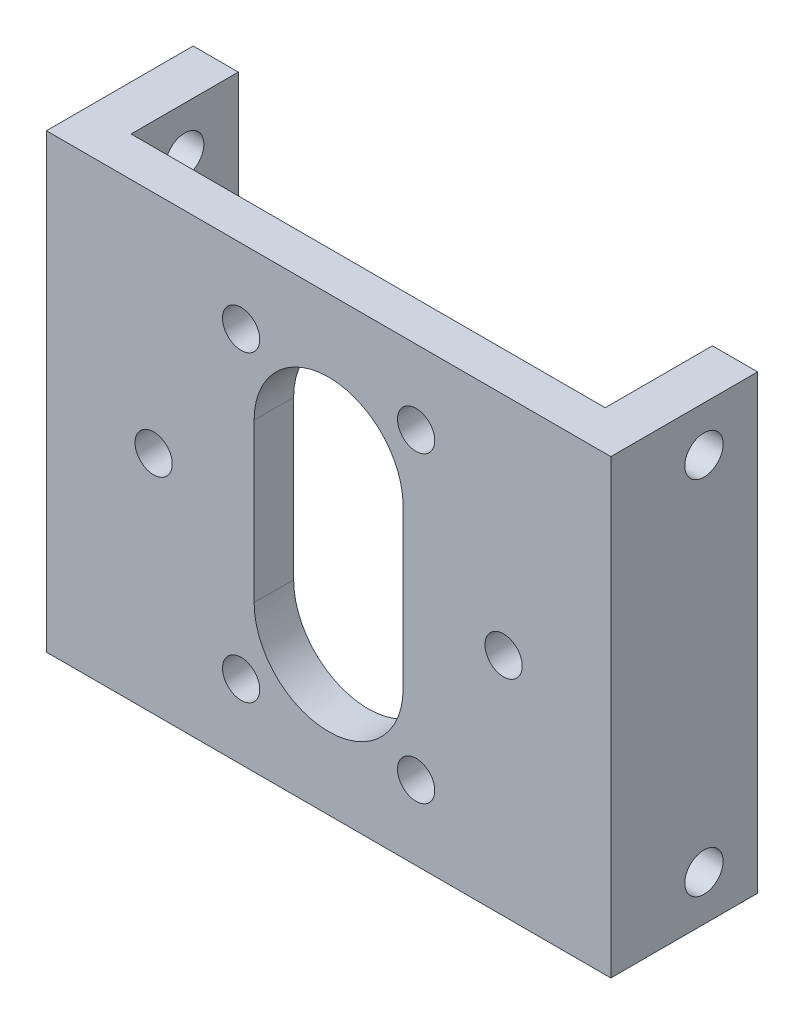
ISO-10303-21;
HEADER;
FILE_DESCRIPTION(('STEP AP214'),'2;1');
FILE_NAME('part.step','',(''),(''),'','','');
FILE_SCHEMA(('AUTOMOTIVE_DESIGN { 1 0 10303 214 1 1 1 1 }'));
ENDSEC;
DATA;
#1=APPLICATION_CONTEXT('core data for automotive mechanical design processes');
#2=APPLICATION_PROTOCOL_DEFINITION('international standard','automotive_design',2000,#1);
#3=PRODUCT_CONTEXT('',#1,'mechanical');
#4=PRODUCT('Part','Part','',(#3));
#5=PRODUCT_RELATED_PRODUCT_CATEGORY('part','',(#4));
#6=PRODUCT_DEFINITION_FORMATION('','',#4);
#7=PRODUCT_DEFINITION_CONTEXT('part definition',#1,'design');
#8=PRODUCT_DEFINITION('design','',#6,#7);
#9=PRODUCT_DEFINITION_SHAPE('','',#8);
#10=(LENGTH_UNIT() NAMED_UNIT(*) SI_UNIT(.MILLI.,.METRE.));
#11=(NAMED_UNIT(*) PLANE_ANGLE_UNIT() SI_UNIT($,.RADIAN.));
#12=(NAMED_UNIT(*) SI_UNIT($,.STERADIAN.) SOLID_ANGLE_UNIT());
#13=UNCERTAINTY_MEASURE_WITH_UNIT(LENGTH_MEASURE(1.E-05),#10,'distance_accuracy_value','');
#14=(GEOMETRIC_REPRESENTATION_CONTEXT(3) GLOBAL_UNCERTAINTY_ASSIGNED_CONTEXT((#13)) GLOBAL_UNIT_ASSIGNED_CONTEXT((#10,
#11,#12)) REPRESENTATION_CONTEXT('',''));
#15=CARTESIAN_POINT('',(0.,0.,0.));
#16=DIRECTION('',(0.,0.,1.));
#17=DIRECTION('',(1.,0.,0.));
#18=AXIS2_PLACEMENT_3D('',#15,#16,#17);
#19=CARTESIAN_POINT('',(-25.,20.,5.));
#20=DIRECTION('',(0.,-1.,0.));
#21=DIRECTION('',(1.,0.,0.));
#22=AXIS2_PLACEMENT_3D('',#19,#20,#21);
#23=PLANE('',#22);
#24=DIRECTION('',(1.,0.,0.));
#25=VECTOR('',#24,1.);
#26=CARTESIAN_POINT('',(19.,20.,1.5));
#27=LINE('',#26,#25);
#28=CARTESIAN_POINT('',(-21.,20.,1.5));
#29=VERTEX_POINT('',#28);
#30=CARTESIAN_POINT('',(21.,20.,1.5));
#31=VERTEX_POINT('',#30);
#32=EDGE_CURVE('E128',#29,#31,#27,.T.);
#33=ORIENTED_EDGE('',*,*,#32,.F.);
#34=DIRECTION('',(0.,0.,-1.));
#35=VECTOR('',#34,1.);
#36=CARTESIAN_POINT('',(-21.,20.,1.5));
#37=LINE('',#36,#35);
#38=CARTESIAN_POINT('',(-21.,20.,-8.));
#39=VERTEX_POINT('',#38);
#40=EDGE_CURVE('E149',#29,#39,#37,.T.);
#41=ORIENTED_EDGE('',*,*,#40,.T.);
#42=DIRECTION('',(1.,0.,0.));
#43=VECTOR('',#42,1.);
#44=CARTESIAN_POINT('',(-19.,20.,-8.));
#45=LINE('',#44,#43);
#46=CARTESIAN_POINT('',(-25.,20.,-8.));
#47=VERTEX_POINT('',#46);
#48=EDGE_CURVE('E251',#47,#39,#45,.T.);
#49=ORIENTED_EDGE('',*,*,#48,.F.);
#50=DIRECTION('',(0.,0.,-1.));
#51=VECTOR('',#50,1.);
#52=CARTESIAN_POINT('',(-25.,20.,5.));
#53=LINE('',#52,#51);
#54=CARTESIAN_POINT('',(-25.,20.,5.));
#55=VERTEX_POINT('',#54);
#56=EDGE_CURVE('E11',#55,#47,#53,.T.);
#57=ORIENTED_EDGE('',*,*,#56,.F.);
#58=DIRECTION('',(-1.,0.,0.));
#59=VECTOR('',#58,1.);
#60=CARTESIAN_POINT('',(-25.,20.,5.));
#61=LINE('',#60,#59);
#62=CARTESIAN_POINT('',(25.,20.,5.));
#63=VERTEX_POINT('',#62);
#64=EDGE_CURVE('E263',#63,#55,#61,.T.);
#65=ORIENTED_EDGE('',*,*,#64,.F.);
#66=DIRECTION('',(0.,0.,-1.));
#67=VECTOR('',#66,1.);
#68=CARTESIAN_POINT('',(25.,20.,5.));
#69=LINE('',#68,#67);
#70=CARTESIAN_POINT('',(25.,20.,-8.));
#71=VERTEX_POINT('',#70);
#72=EDGE_CURVE('E272',#63,#71,#69,.T.);
#73=ORIENTED_EDGE('',*,*,#72,.T.);
#74=DIRECTION('',(1.,0.,0.));
#75=VECTOR('',#74,1.);
#76=CARTESIAN_POINT('',(19.,20.,-8.));
#77=LINE('',#76,#75);
#78=CARTESIAN_POINT('',(21.,20.,-8.));
#79=VERTEX_POINT('',#78);
#80=EDGE_CURVE('E148',#79,#71,#77,.T.);
#81=ORIENTED_EDGE('',*,*,#80,.F.);
#82=DIRECTION('',(0.,0.,1.));
#83=VECTOR('',#82,1.);
#84=CARTESIAN_POINT('',(21.,20.,-8.));
#85=LINE('',#84,#83);
#86=EDGE_CURVE('E53',#79,#31,#85,.T.);
#87=ORIENTED_EDGE('',*,*,#86,.T.);
#88=EDGE_LOOP('',(#33,#41,#49,#57,#65,#73,#81,#87));
#89=FACE_BOUND('',#88,.T.);
#90=ADVANCED_FACE('F37',(#89),#23,.F.);
#91=CARTESIAN_POINT('',(-25.,20.,5.));
#92=DIRECTION('',(1.,0.,0.));
#93=DIRECTION('',(0.,1.,0.));
#94=AXIS2_PLACEMENT_3D('',#91,#92,#93);
#95=PLANE('',#94);
#96=CARTESIAN_POINT('',(-25.,-16.,-3.25));
#97=DIRECTION('',(1.,0.,0.));
#98=DIRECTION('',(0.,0.,-1.));
#99=AXIS2_PLACEMENT_3D('',#96,#97,#98);
#100=CIRCLE('',#99,1.7);
#101=CARTESIAN_POINT('',(-25.,-16.,-4.95));
#102=VERTEX_POINT('',#101);
#103=EDGE_CURVE('E169',#102,#102,#100,.T.);
#104=ORIENTED_EDGE('',*,*,#103,.T.);
#105=EDGE_LOOP('',(#104));
#106=FACE_BOUND('',#105,.T.);
#107=CARTESIAN_POINT('',(-25.,16.,-3.25));
#108=DIRECTION('',(1.,0.,0.));
#109=DIRECTION('',(0.,0.,-1.));
#110=AXIS2_PLACEMENT_3D('',#107,#108,#109);
#111=CIRCLE('',#110,1.7);
#112=CARTESIAN_POINT('',(-25.,16.,-4.95000000000001));
#113=VERTEX_POINT('',#112);
#114=EDGE_CURVE('E138',#113,#113,#111,.T.);
#115=ORIENTED_EDGE('',*,*,#114,.T.);
#116=EDGE_LOOP('',(#115));
#117=FACE_BOUND('',#116,.T.);
#118=ORIENTED_EDGE('',*,*,#56,.T.);
#119=DIRECTION('',(0.,1.,0.));
#120=VECTOR('',#119,1.);
#121=CARTESIAN_POINT('',(-25.,20.,-8.));
#122=LINE('',#121,#120);
#123=CARTESIAN_POINT('',(-25.,-20.,-8.));
#124=VERTEX_POINT('',#123);
#125=EDGE_CURVE('E248',#124,#47,#122,.T.);
#126=ORIENTED_EDGE('',*,*,#125,.F.);
#127=DIRECTION('',(0.,0.,-1.));
#128=VECTOR('',#127,1.);
#129=CARTESIAN_POINT('',(-25.,-20.,5.));
#130=LINE('',#129,#128);
#131=CARTESIAN_POINT('',(-25.,-20.,5.));
#132=VERTEX_POINT('',#131);
#133=EDGE_CURVE('E45',#132,#124,#130,.T.);
#134=ORIENTED_EDGE('',*,*,#133,.F.);
#135=DIRECTION('',(0.,-1.,0.));
#136=VECTOR('',#135,1.);
#137=CARTESIAN_POINT('',(-25.,20.,5.));
#138=LINE('',#137,#136);
#139=EDGE_CURVE('E266',#55,#132,#138,.T.);
#140=ORIENTED_EDGE('',*,*,#139,.F.);
#141=EDGE_LOOP('',(#118,#126,#134,#140));
#142=FACE_BOUND('',#141,.T.);
#143=ADVANCED_FACE('F297',(#106,#117,#142),#95,.F.);
#144=CARTESIAN_POINT('',(25.,-20.,5.));
#145=DIRECTION('',(0.,1.,0.));
#146=DIRECTION('',(-1.,0.,0.));
#147=AXIS2_PLACEMENT_3D('',#144,#145,#146);
#148=PLANE('',#147);
#149=DIRECTION('',(-1.,0.,0.));
#150=VECTOR('',#149,1.);
#151=CARTESIAN_POINT('',(-25.,-20.,-8.));
#152=LINE('',#151,#150);
#153=CARTESIAN_POINT('',(-21.,-20.,-8.));
#154=VERTEX_POINT('',#153);
#155=EDGE_CURVE('E254',#154,#124,#152,.T.);
#156=ORIENTED_EDGE('',*,*,#155,.F.);
#157=DIRECTION('',(0.,0.,-1.));
#158=VECTOR('',#157,1.);
#159=CARTESIAN_POINT('',(-21.,-20.,1.5));
#160=LINE('',#159,#158);
#161=CARTESIAN_POINT('',(-21.,-20.,1.5));
#162=VERTEX_POINT('',#161);
#163=EDGE_CURVE('E61',#162,#154,#160,.T.);
#164=ORIENTED_EDGE('',*,*,#163,.F.);
#165=DIRECTION('',(-1.,0.,0.));
#166=VECTOR('',#165,1.);
#167=CARTESIAN_POINT('',(-19.,-20.,1.5));
#168=LINE('',#167,#166);
#169=CARTESIAN_POINT('',(21.,-20.,1.5));
#170=VERTEX_POINT('',#169);
#171=EDGE_CURVE('E137',#170,#162,#168,.T.);
#172=ORIENTED_EDGE('',*,*,#171,.F.);
#173=DIRECTION('',(0.,0.,1.));
#174=VECTOR('',#173,1.);
#175=CARTESIAN_POINT('',(21.,-20.,-8.));
#176=LINE('',#175,#174);
#177=CARTESIAN_POINT('',(21.,-20.,-8.));
#178=VERTEX_POINT('',#177);
#179=EDGE_CURVE('E143',#178,#170,#176,.T.);
#180=ORIENTED_EDGE('',*,*,#179,.F.);
#181=DIRECTION('',(-1.,0.,0.));
#182=VECTOR('',#181,1.);
#183=CARTESIAN_POINT('',(25.,-20.,-8.));
#184=LINE('',#183,#182);
#185=CARTESIAN_POINT('',(25.,-20.,-8.));
#186=VERTEX_POINT('',#185);
#187=EDGE_CURVE('E256',#186,#178,#184,.T.);
#188=ORIENTED_EDGE('',*,*,#187,.F.);
#189=DIRECTION('',(0.,0.,-1.));
#190=VECTOR('',#189,1.);
#191=CARTESIAN_POINT('',(25.,-20.,5.));
#192=LINE('',#191,#190);
#193=CARTESIAN_POINT('',(25.,-20.,5.));
#194=VERTEX_POINT('',#193);
#195=EDGE_CURVE('E274',#194,#186,#192,.T.);
#196=ORIENTED_EDGE('',*,*,#195,.F.);
#197=DIRECTION('',(1.,0.,0.));
#198=VECTOR('',#197,1.);
#199=CARTESIAN_POINT('',(25.,-20.,5.));
#200=LINE('',#199,#198);
#201=EDGE_CURVE('E268',#132,#194,#200,.T.);
#202=ORIENTED_EDGE('',*,*,#201,.F.);
#203=ORIENTED_EDGE('',*,*,#133,.T.);
#204=EDGE_LOOP('',(#156,#164,#172,#180,#188,#196,#202,#203));
#205=FACE_BOUND('',#204,.T.);
#206=ADVANCED_FACE('F301',(#205),#148,.F.);
#207=CARTESIAN_POINT('',(25.,20.,5.));
#208=DIRECTION('',(-1.,0.,0.));
#209=DIRECTION('',(0.,0.,1.));
#210=AXIS2_PLACEMENT_3D('',#207,#208,#209);
#211=PLANE('',#210);
#212=CARTESIAN_POINT('',(25.,-16.,-3.25));
#213=DIRECTION('',(1.,0.,0.));
#214=DIRECTION('',(0.,0.,-1.));
#215=AXIS2_PLACEMENT_3D('',#212,#213,#214);
#216=CIRCLE('',#215,1.7);
#217=CARTESIAN_POINT('',(25.,-16.,-4.95));
#218=VERTEX_POINT('',#217);
#219=EDGE_CURVE('E166',#218,#218,#216,.T.);
#220=ORIENTED_EDGE('',*,*,#219,.F.);
#221=EDGE_LOOP('',(#220));
#222=FACE_BOUND('',#221,.T.);
#223=CARTESIAN_POINT('',(25.,16.,-3.25));
#224=DIRECTION('',(1.,0.,0.));
#225=DIRECTION('',(0.,0.,-1.));
#226=AXIS2_PLACEMENT_3D('',#223,#224,#225);
#227=CIRCLE('',#226,1.7);
#228=CARTESIAN_POINT('',(25.,16.,-4.95000000000001));
#229=VERTEX_POINT('',#228);
#230=EDGE_CURVE('E172',#229,#229,#227,.T.);
#231=ORIENTED_EDGE('',*,*,#230,.F.);
#232=EDGE_LOOP('',(#231));
#233=FACE_BOUND('',#232,.T.);
#234=ORIENTED_EDGE('',*,*,#195,.T.);
#235=DIRECTION('',(0.,-1.,0.));
#236=VECTOR('',#235,1.);
#237=CARTESIAN_POINT('',(25.,20.,-8.));
#238=LINE('',#237,#236);
#239=EDGE_CURVE('E260',#71,#186,#238,.T.);
#240=ORIENTED_EDGE('',*,*,#239,.F.);
#241=ORIENTED_EDGE('',*,*,#72,.F.);
#242=DIRECTION('',(0.,1.,0.));
#243=VECTOR('',#242,1.);
#244=CARTESIAN_POINT('',(25.,20.,5.));
#245=LINE('',#244,#243);
#246=EDGE_CURVE('E270',#194,#63,#245,.T.);
#247=ORIENTED_EDGE('',*,*,#246,.F.);
#248=EDGE_LOOP('',(#234,#240,#241,#247));
#249=FACE_BOUND('',#248,.T.);
#250=ADVANCED_FACE('F306',(#222,#233,#249),#211,.F.);
#251=CARTESIAN_POINT('',(0.,0.,5.));
#252=DIRECTION('',(0.,0.,-1.));
#253=DIRECTION('',(-1.,0.,0.));
#254=AXIS2_PLACEMENT_3D('',#251,#252,#253);
#255=PLANE('',#254);
#256=CARTESIAN_POINT('',(-7.74999999999987,-13.4233937586589,5.));
#257=DIRECTION('',(0.,0.,-1.));
#258=DIRECTION('',(-1.,0.,0.));
#259=AXIS2_PLACEMENT_3D('',#256,#257,#258);
#260=CIRCLE('',#259,1.65);
#261=CARTESIAN_POINT('',(-9.39999999999988,-13.4233937586589,5.));
#262=VERTEX_POINT('',#261);
#263=EDGE_CURVE('E233',#262,#262,#260,.T.);
#264=ORIENTED_EDGE('',*,*,#263,.T.);
#265=EDGE_LOOP('',(#264));
#266=FACE_BOUND('',#265,.T.);
#267=DIRECTION('',(0.,1.,0.));
#268=VECTOR('',#267,1.);
#269=CARTESIAN_POINT('',(-6.6,7.,5.));
#270=LINE('',#269,#268);
#271=CARTESIAN_POINT('',(-6.6,-7.,5.));
#272=VERTEX_POINT('',#271);
#273=CARTESIAN_POINT('',(-6.6,7.,5.));
#274=VERTEX_POINT('',#273);
#275=EDGE_CURVE('E215',#272,#274,#270,.T.);
#276=ORIENTED_EDGE('',*,*,#275,.T.);
#277=CARTESIAN_POINT('',(0.,7.,5.));
#278=DIRECTION('',(0.,0.,-1.));
#279=DIRECTION('',(-1.,0.,0.));
#280=AXIS2_PLACEMENT_3D('',#277,#278,#279);
#281=CIRCLE('',#280,6.6);
#282=CARTESIAN_POINT('',(6.6,7.,5.));
#283=VERTEX_POINT('',#282);
#284=EDGE_CURVE('E206',#274,#283,#281,.T.);
#285=ORIENTED_EDGE('',*,*,#284,.T.);
#286=DIRECTION('',(0.,-1.,0.));
#287=VECTOR('',#286,1.);
#288=CARTESIAN_POINT('',(6.6,7.,5.));
#289=LINE('',#288,#287);
#290=CARTESIAN_POINT('',(6.6,-7.,5.));
#291=VERTEX_POINT('',#290);
#292=EDGE_CURVE('E209',#283,#291,#289,.T.);
#293=ORIENTED_EDGE('',*,*,#292,.T.);
#294=CARTESIAN_POINT('',(0.,-7.,5.));
#295=DIRECTION('',(0.,0.,-1.));
#296=DIRECTION('',(-1.,0.,0.));
#297=AXIS2_PLACEMENT_3D('',#294,#295,#296);
#298=CIRCLE('',#297,6.6);
#299=EDGE_CURVE('E212',#291,#272,#298,.T.);
#300=ORIENTED_EDGE('',*,*,#299,.T.);
#301=EDGE_LOOP('',(#276,#285,#293,#300));
#302=FACE_BOUND('',#301,.T.);
#303=CARTESIAN_POINT('',(7.75000000000016,-13.4233937586587,5.));
#304=DIRECTION('',(0.,0.,-1.));
#305=DIRECTION('',(-1.,0.,0.));
#306=AXIS2_PLACEMENT_3D('',#303,#304,#305);
#307=CIRCLE('',#306,1.65);
#308=CARTESIAN_POINT('',(6.10000000000016,-13.4233937586587,5.));
#309=VERTEX_POINT('',#308);
#310=EDGE_CURVE('E222',#309,#309,#307,.T.);
#311=ORIENTED_EDGE('',*,*,#310,.T.);
#312=EDGE_LOOP('',(#311));
#313=FACE_BOUND('',#312,.T.);
#314=CARTESIAN_POINT('',(-15.5,-1.08235921504137E-13,5.));
#315=DIRECTION('',(0.,0.,-1.));
#316=DIRECTION('',(-1.,0.,0.));
#317=AXIS2_PLACEMENT_3D('',#314,#315,#316);
#318=CIRCLE('',#317,1.65);
#319=CARTESIAN_POINT('',(-17.15,-1.08235921504137E-13,5.));
#320=VERTEX_POINT('',#319);
#321=EDGE_CURVE('E236',#320,#320,#318,.T.);
#322=ORIENTED_EDGE('',*,*,#321,.T.);
#323=EDGE_LOOP('',(#322));
#324=FACE_BOUND('',#323,.T.);
#325=CARTESIAN_POINT('',(-7.75000000000006,13.4233937586588,5.));
#326=DIRECTION('',(0.,0.,-1.));
#327=DIRECTION('',(-1.,0.,0.));
#328=AXIS2_PLACEMENT_3D('',#325,#326,#327);
#329=CIRCLE('',#328,1.65);
#330=CARTESIAN_POINT('',(-9.40000000000006,13.4233937586588,5.));
#331=VERTEX_POINT('',#330);
#332=EDGE_CURVE('E241',#331,#331,#329,.T.);
#333=ORIENTED_EDGE('',*,*,#332,.T.);
#334=EDGE_LOOP('',(#333));
#335=FACE_BOUND('',#334,.T.);
#336=CARTESIAN_POINT('',(7.74999999999997,13.4233937586588,5.));
#337=DIRECTION('',(0.,0.,-1.));
#338=DIRECTION('',(-1.,0.,0.));
#339=AXIS2_PLACEMENT_3D('',#336,#337,#338);
#340=CIRCLE('',#339,1.65);
#341=CARTESIAN_POINT('',(6.09999999999997,13.4233937586588,5.));
#342=VERTEX_POINT('',#341);
#343=EDGE_CURVE('E237',#342,#342,#340,.T.);
#344=ORIENTED_EDGE('',*,*,#343,.T.);
#345=EDGE_LOOP('',(#344));
#346=FACE_BOUND('',#345,.T.);
#347=CARTESIAN_POINT('',(15.5,0.,5.));
#348=DIRECTION('',(0.,0.,-1.));
#349=DIRECTION('',(-1.,0.,0.));
#350=AXIS2_PLACEMENT_3D('',#347,#348,#349);
#351=CIRCLE('',#350,1.65);
#352=CARTESIAN_POINT('',(13.85,0.,5.));
#353=VERTEX_POINT('',#352);
#354=EDGE_CURVE('E240',#353,#353,#351,.T.);
#355=ORIENTED_EDGE('',*,*,#354,.T.);
#356=EDGE_LOOP('',(#355));
#357=FACE_BOUND('',#356,.T.);
#358=ORIENTED_EDGE('',*,*,#64,.T.);
#359=ORIENTED_EDGE('',*,*,#139,.T.);
#360=ORIENTED_EDGE('',*,*,#201,.T.);
#361=ORIENTED_EDGE('',*,*,#246,.T.);
#362=EDGE_LOOP('',(#358,#359,#360,#361));
#363=FACE_BOUND('',#362,.T.);
#364=ADVANCED_FACE('F313',(#266,#302,#313,#324,#335,#346,#357,#363),#255,.F.);
#365=CARTESIAN_POINT('',(0.,0.,-8.));
#366=DIRECTION('',(0.,0.,-1.));
#367=DIRECTION('',(-1.,0.,0.));
#368=AXIS2_PLACEMENT_3D('',#365,#366,#367);
#369=PLANE('',#368);
#370=DIRECTION('',(0.,-1.,0.));
#371=VECTOR('',#370,1.);
#372=CARTESIAN_POINT('',(21.,20.,-8.));
#373=LINE('',#372,#371);
#374=EDGE_CURVE('E144',#79,#178,#373,.T.);
#375=ORIENTED_EDGE('',*,*,#374,.F.);
#376=ORIENTED_EDGE('',*,*,#80,.T.);
#377=ORIENTED_EDGE('',*,*,#239,.T.);
#378=ORIENTED_EDGE('',*,*,#187,.T.);
#379=EDGE_LOOP('',(#375,#376,#377,#378));
#380=FACE_BOUND('',#379,.T.);
#381=ADVANCED_FACE('F317',(#380),#369,.T.);
#382=CARTESIAN_POINT('',(0.,0.,-8.));
#383=DIRECTION('',(0.,0.,1.));
#384=DIRECTION('',(1.,0.,0.));
#385=AXIS2_PLACEMENT_3D('',#382,#383,#384);
#386=PLANE('',#385);
#387=ORIENTED_EDGE('',*,*,#48,.T.);
#388=DIRECTION('',(0.,-1.,0.));
#389=VECTOR('',#388,1.);
#390=CARTESIAN_POINT('',(-21.,20.,-8.));
#391=LINE('',#390,#389);
#392=EDGE_CURVE('E155',#39,#154,#391,.T.);
#393=ORIENTED_EDGE('',*,*,#392,.T.);
#394=ORIENTED_EDGE('',*,*,#155,.T.);
#395=ORIENTED_EDGE('',*,*,#125,.T.);
#396=EDGE_LOOP('',(#387,#393,#394,#395));
#397=FACE_BOUND('',#396,.T.);
#398=ADVANCED_FACE('F321',(#397),#386,.F.);
#399=CARTESIAN_POINT('',(15.5,0.,5.));
#400=DIRECTION('',(0.,0.,-1.));
#401=DIRECTION('',(-1.,0.,0.));
#402=AXIS2_PLACEMENT_3D('',#399,#400,#401);
#403=CYLINDRICAL_SURFACE('',#402,1.65);
#404=CARTESIAN_POINT('',(15.5,0.,1.5));
#405=DIRECTION('',(0.,0.,1.));
#406=DIRECTION('',(1.,0.,0.));
#407=AXIS2_PLACEMENT_3D('',#404,#405,#406);
#408=CIRCLE('',#407,1.65);
#409=CARTESIAN_POINT('',(17.15,0.,1.5));
#410=VERTEX_POINT('',#409);
#411=EDGE_CURVE('E203',#410,#410,#408,.F.);
#412=ORIENTED_EDGE('',*,*,#411,.T.);
#413=EDGE_LOOP('',(#412));
#414=FACE_BOUND('',#413,.T.);
#415=ORIENTED_EDGE('',*,*,#354,.F.);
#416=EDGE_LOOP('',(#415));
#417=FACE_BOUND('',#416,.T.);
#418=ADVANCED_FACE('F325',(#414,#417),#403,.F.);
#419=CARTESIAN_POINT('',(7.74999999999997,13.4233937586588,5.));
#420=DIRECTION('',(0.,0.,-1.));
#421=DIRECTION('',(-1.,0.,0.));
#422=AXIS2_PLACEMENT_3D('',#419,#420,#421);
#423=CYLINDRICAL_SURFACE('',#422,1.65);
#424=CARTESIAN_POINT('',(7.74999999999997,13.4233937586588,1.5));
#425=DIRECTION('',(0.,0.,1.));
#426=DIRECTION('',(1.,0.,0.));
#427=AXIS2_PLACEMENT_3D('',#424,#425,#426);
#428=CIRCLE('',#427,1.65);
#429=CARTESIAN_POINT('',(9.39999999999997,13.4233937586588,1.5));
#430=VERTEX_POINT('',#429);
#431=EDGE_CURVE('E200',#430,#430,#428,.F.);
#432=ORIENTED_EDGE('',*,*,#431,.T.);
#433=EDGE_LOOP('',(#432));
#434=FACE_BOUND('',#433,.T.);
#435=ORIENTED_EDGE('',*,*,#343,.F.);
#436=EDGE_LOOP('',(#435));
#437=FACE_BOUND('',#436,.T.);
#438=ADVANCED_FACE('F329',(#434,#437),#423,.F.);
#439=CARTESIAN_POINT('',(-7.75000000000006,13.4233937586588,5.));
#440=DIRECTION('',(0.,0.,-1.));
#441=DIRECTION('',(-1.,0.,0.));
#442=AXIS2_PLACEMENT_3D('',#439,#440,#441);
#443=CYLINDRICAL_SURFACE('',#442,1.65);
#444=CARTESIAN_POINT('',(-7.75000000000006,13.4233937586588,1.5));
#445=DIRECTION('',(0.,0.,1.));
#446=DIRECTION('',(1.,0.,0.));
#447=AXIS2_PLACEMENT_3D('',#444,#445,#446);
#448=CIRCLE('',#447,1.65);
#449=CARTESIAN_POINT('',(-6.10000000000006,13.4233937586588,1.5));
#450=VERTEX_POINT('',#449);
#451=EDGE_CURVE('E197',#450,#450,#448,.F.);
#452=ORIENTED_EDGE('',*,*,#451,.T.);
#453=EDGE_LOOP('',(#452));
#454=FACE_BOUND('',#453,.T.);
#455=ORIENTED_EDGE('',*,*,#332,.F.);
#456=EDGE_LOOP('',(#455));
#457=FACE_BOUND('',#456,.T.);
#458=ADVANCED_FACE('F335',(#454,#457),#443,.F.);
#459=CARTESIAN_POINT('',(-15.5,-1.08235921504137E-13,5.));
#460=DIRECTION('',(0.,0.,-1.));
#461=DIRECTION('',(-1.,0.,0.));
#462=AXIS2_PLACEMENT_3D('',#459,#460,#461);
#463=CYLINDRICAL_SURFACE('',#462,1.65);
#464=CARTESIAN_POINT('',(-15.5,-1.08235921504137E-13,1.5));
#465=DIRECTION('',(0.,0.,1.));
#466=DIRECTION('',(1.,0.,0.));
#467=AXIS2_PLACEMENT_3D('',#464,#465,#466);
#468=CIRCLE('',#467,1.65);
#469=CARTESIAN_POINT('',(-13.85,-1.08235921504137E-13,1.5));
#470=VERTEX_POINT('',#469);
#471=EDGE_CURVE('E194',#470,#470,#468,.F.);
#472=ORIENTED_EDGE('',*,*,#471,.T.);
#473=EDGE_LOOP('',(#472));
#474=FACE_BOUND('',#473,.T.);
#475=ORIENTED_EDGE('',*,*,#321,.F.);
#476=EDGE_LOOP('',(#475));
#477=FACE_BOUND('',#476,.T.);
#478=ADVANCED_FACE('F331',(#474,#477),#463,.F.);
#479=CARTESIAN_POINT('',(7.75000000000016,-13.4233937586587,5.));
#480=DIRECTION('',(0.,0.,-1.));
#481=DIRECTION('',(-1.,0.,0.));
#482=AXIS2_PLACEMENT_3D('',#479,#480,#481);
#483=CYLINDRICAL_SURFACE('',#482,1.65);
#484=CARTESIAN_POINT('',(7.75000000000016,-13.4233937586587,1.5));
#485=DIRECTION('',(0.,0.,1.));
#486=DIRECTION('',(1.,0.,0.));
#487=AXIS2_PLACEMENT_3D('',#484,#485,#486);
#488=CIRCLE('',#487,1.65);
#489=CARTESIAN_POINT('',(9.40000000000016,-13.4233937586587,1.5));
#490=VERTEX_POINT('',#489);
#491=EDGE_CURVE('E191',#490,#490,#488,.F.);
#492=ORIENTED_EDGE('',*,*,#491,.T.);
#493=EDGE_LOOP('',(#492));
#494=FACE_BOUND('',#493,.T.);
#495=ORIENTED_EDGE('',*,*,#310,.F.);
#496=EDGE_LOOP('',(#495));
#497=FACE_BOUND('',#496,.T.);
#498=ADVANCED_FACE('F334',(#494,#497),#483,.F.);
#499=CARTESIAN_POINT('',(0.,7.,5.));
#500=DIRECTION('',(0.,0.,-1.));
#501=DIRECTION('',(-1.,0.,0.));
#502=AXIS2_PLACEMENT_3D('',#499,#500,#501);
#503=CYLINDRICAL_SURFACE('',#502,6.6);
#504=DIRECTION('',(0.,0.,-1.));
#505=VECTOR('',#504,1.);
#506=CARTESIAN_POINT('',(-6.6,7.,5.));
#507=LINE('',#506,#505);
#508=CARTESIAN_POINT('',(-6.6,7.,1.5));
#509=VERTEX_POINT('',#508);
#510=EDGE_CURVE('E219',#274,#509,#507,.T.);
#511=ORIENTED_EDGE('',*,*,#510,.T.);
#512=CARTESIAN_POINT('',(0.,7.,1.5));
#513=DIRECTION('',(0.,0.,1.));
#514=DIRECTION('',(1.,0.,0.));
#515=AXIS2_PLACEMENT_3D('',#512,#513,#514);
#516=CIRCLE('',#515,6.6);
#517=CARTESIAN_POINT('',(6.6,7.,1.5));
#518=VERTEX_POINT('',#517);
#519=EDGE_CURVE('E188',#509,#518,#516,.F.);
#520=ORIENTED_EDGE('',*,*,#519,.T.);
#521=DIRECTION('',(0.,0.,-1.));
#522=VECTOR('',#521,1.);
#523=CARTESIAN_POINT('',(6.6,7.,5.));
#524=LINE('',#523,#522);
#525=EDGE_CURVE('E218',#283,#518,#524,.T.);
#526=ORIENTED_EDGE('',*,*,#525,.F.);
#527=ORIENTED_EDGE('',*,*,#284,.F.);
#528=EDGE_LOOP('',(#511,#520,#526,#527));
#529=FACE_BOUND('',#528,.T.);
#530=ADVANCED_FACE('F350',(#529),#503,.F.);
#531=CARTESIAN_POINT('',(-6.6,7.,5.));
#532=DIRECTION('',(-1.,0.,0.));
#533=DIRECTION('',(0.,0.,1.));
#534=AXIS2_PLACEMENT_3D('',#531,#532,#533);
#535=PLANE('',#534);
#536=DIRECTION('',(0.,0.,-1.));
#537=VECTOR('',#536,1.);
#538=CARTESIAN_POINT('',(-6.6,-7.,5.));
#539=LINE('',#538,#537);
#540=CARTESIAN_POINT('',(-6.6,-7.,1.5));
#541=VERTEX_POINT('',#540);
#542=EDGE_CURVE('E223',#272,#541,#539,.T.);
#543=ORIENTED_EDGE('',*,*,#542,.T.);
#544=DIRECTION('',(0.,1.,0.));
#545=VECTOR('',#544,1.);
#546=CARTESIAN_POINT('',(-6.6,7.,1.5));
#547=LINE('',#546,#545);
#548=EDGE_CURVE('E185',#541,#509,#547,.T.);
#549=ORIENTED_EDGE('',*,*,#548,.T.);
#550=ORIENTED_EDGE('',*,*,#510,.F.);
#551=ORIENTED_EDGE('',*,*,#275,.F.);
#552=EDGE_LOOP('',(#543,#549,#550,#551));
#553=FACE_BOUND('',#552,.T.);
#554=ADVANCED_FACE('F354',(#553),#535,.F.);
#555=CARTESIAN_POINT('',(0.,-7.,5.));
#556=DIRECTION('',(0.,0.,-1.));
#557=DIRECTION('',(-1.,0.,0.));
#558=AXIS2_PLACEMENT_3D('',#555,#556,#557);
#559=CYLINDRICAL_SURFACE('',#558,6.6);
#560=DIRECTION('',(0.,0.,-1.));
#561=VECTOR('',#560,1.);
#562=CARTESIAN_POINT('',(6.6,-7.,5.));
#563=LINE('',#562,#561);
#564=CARTESIAN_POINT('',(6.6,-7.,1.5));
#565=VERTEX_POINT('',#564);
#566=EDGE_CURVE('E226',#291,#565,#563,.T.);
#567=ORIENTED_EDGE('',*,*,#566,.T.);
#568=CARTESIAN_POINT('',(0.,-7.,1.5));
#569=DIRECTION('',(0.,0.,1.));
#570=DIRECTION('',(1.,0.,0.));
#571=AXIS2_PLACEMENT_3D('',#568,#569,#570);
#572=CIRCLE('',#571,6.6);
#573=EDGE_CURVE('E182',#565,#541,#572,.F.);
#574=ORIENTED_EDGE('',*,*,#573,.T.);
#575=ORIENTED_EDGE('',*,*,#542,.F.);
#576=ORIENTED_EDGE('',*,*,#299,.F.);
#577=EDGE_LOOP('',(#567,#574,#575,#576));
#578=FACE_BOUND('',#577,.T.);
#579=ADVANCED_FACE('F358',(#578),#559,.F.);
#580=CARTESIAN_POINT('',(6.6,7.,5.));
#581=DIRECTION('',(1.,0.,0.));
#582=DIRECTION('',(0.,0.,-1.));
#583=AXIS2_PLACEMENT_3D('',#580,#581,#582);
#584=PLANE('',#583);
#585=ORIENTED_EDGE('',*,*,#525,.T.);
#586=DIRECTION('',(0.,-1.,0.));
#587=VECTOR('',#586,1.);
#588=CARTESIAN_POINT('',(6.6,7.,1.5));
#589=LINE('',#588,#587);
#590=EDGE_CURVE('E179',#518,#565,#589,.T.);
#591=ORIENTED_EDGE('',*,*,#590,.T.);
#592=ORIENTED_EDGE('',*,*,#566,.F.);
#593=ORIENTED_EDGE('',*,*,#292,.F.);
#594=EDGE_LOOP('',(#585,#591,#592,#593));
#595=FACE_BOUND('',#594,.T.);
#596=ADVANCED_FACE('F346',(#595),#584,.F.);
#597=CARTESIAN_POINT('',(-7.74999999999987,-13.4233937586589,5.));
#598=DIRECTION('',(0.,0.,-1.));
#599=DIRECTION('',(-1.,0.,0.));
#600=AXIS2_PLACEMENT_3D('',#597,#598,#599);
#601=CYLINDRICAL_SURFACE('',#600,1.65);
#602=CARTESIAN_POINT('',(-7.74999999999987,-13.4233937586589,1.5));
#603=DIRECTION('',(0.,0.,1.));
#604=DIRECTION('',(1.,0.,0.));
#605=AXIS2_PLACEMENT_3D('',#602,#603,#604);
#606=CIRCLE('',#605,1.65);
#607=CARTESIAN_POINT('',(-6.09999999999987,-13.4233937586589,1.5));
#608=VERTEX_POINT('',#607);
#609=EDGE_CURVE('E178',#608,#608,#606,.F.);
#610=ORIENTED_EDGE('',*,*,#609,.T.);
#611=EDGE_LOOP('',(#610));
#612=FACE_BOUND('',#611,.T.);
#613=ORIENTED_EDGE('',*,*,#263,.F.);
#614=EDGE_LOOP('',(#613));
#615=FACE_BOUND('',#614,.T.);
#616=ADVANCED_FACE('F343',(#612,#615),#601,.F.);
#617=CARTESIAN_POINT('',(0.,0.,1.5));
#618=DIRECTION('',(0.,0.,1.));
#619=DIRECTION('',(1.,0.,0.));
#620=AXIS2_PLACEMENT_3D('',#617,#618,#619);
#621=PLANE('',#620);
#622=ORIENTED_EDGE('',*,*,#431,.F.);
#623=EDGE_LOOP('',(#622));
#624=FACE_BOUND('',#623,.T.);
#625=ORIENTED_EDGE('',*,*,#471,.F.);
#626=EDGE_LOOP('',(#625));
#627=FACE_BOUND('',#626,.T.);
#628=ORIENTED_EDGE('',*,*,#548,.F.);
#629=ORIENTED_EDGE('',*,*,#573,.F.);
#630=ORIENTED_EDGE('',*,*,#590,.F.);
#631=ORIENTED_EDGE('',*,*,#519,.F.);
#632=EDGE_LOOP('',(#628,#629,#630,#631));
#633=FACE_BOUND('',#632,.T.);
#634=ORIENTED_EDGE('',*,*,#609,.F.);
#635=EDGE_LOOP('',(#634));
#636=FACE_BOUND('',#635,.T.);
#637=ORIENTED_EDGE('',*,*,#171,.T.);
#638=DIRECTION('',(0.,-1.,0.));
#639=VECTOR('',#638,1.);
#640=CARTESIAN_POINT('',(-21.,20.,1.5));
#641=LINE('',#640,#639);
#642=EDGE_CURVE('E133',#29,#162,#641,.T.);
#643=ORIENTED_EDGE('',*,*,#642,.F.);
#644=ORIENTED_EDGE('',*,*,#32,.T.);
#645=DIRECTION('',(0.,-1.,0.));
#646=VECTOR('',#645,1.);
#647=CARTESIAN_POINT('',(21.,20.,1.5));
#648=LINE('',#647,#646);
#649=EDGE_CURVE('E131',#31,#170,#648,.T.);
#650=ORIENTED_EDGE('',*,*,#649,.T.);
#651=EDGE_LOOP('',(#637,#643,#644,#650));
#652=FACE_BOUND('',#651,.T.);
#653=ORIENTED_EDGE('',*,*,#491,.F.);
#654=EDGE_LOOP('',(#653));
#655=FACE_BOUND('',#654,.T.);
#656=ORIENTED_EDGE('',*,*,#451,.F.);
#657=EDGE_LOOP('',(#656));
#658=FACE_BOUND('',#657,.T.);
#659=ORIENTED_EDGE('',*,*,#411,.F.);
#660=EDGE_LOOP('',(#659));
#661=FACE_BOUND('',#660,.T.);
#662=ADVANCED_FACE('F129',(#624,#627,#633,#636,#652,#655,#658,#661),#621,.F.);
#663=CARTESIAN_POINT('',(-25.,16.,-3.25));
#664=DIRECTION('',(1.,0.,0.));
#665=DIRECTION('',(0.,0.,-1.));
#666=AXIS2_PLACEMENT_3D('',#663,#664,#665);
#667=CYLINDRICAL_SURFACE('',#666,1.7);
#668=CARTESIAN_POINT('',(-21.,16.,-3.25));
#669=DIRECTION('',(-1.,0.,0.));
#670=DIRECTION('',(0.,-1.,0.));
#671=AXIS2_PLACEMENT_3D('',#668,#669,#670);
#672=CIRCLE('',#671,1.7);
#673=CARTESIAN_POINT('',(-21.,14.3,-3.25));
#674=VERTEX_POINT('',#673);
#675=EDGE_CURVE('E163',#674,#674,#672,.F.);
#676=ORIENTED_EDGE('',*,*,#675,.T.);
#677=EDGE_LOOP('',(#676));
#678=FACE_BOUND('',#677,.T.);
#679=ORIENTED_EDGE('',*,*,#114,.F.);
#680=EDGE_LOOP('',(#679));
#681=FACE_BOUND('',#680,.T.);
#682=ADVANCED_FACE('F368',(#678,#681),#667,.F.);
#683=CARTESIAN_POINT('',(21.,16.,-3.25));
#684=DIRECTION('',(1.,0.,0.));
#685=DIRECTION('',(0.,1.,0.));
#686=AXIS2_PLACEMENT_3D('',#683,#684,#685);
#687=CIRCLE('',#686,1.7);
#688=CARTESIAN_POINT('',(21.,17.7,-3.25));
#689=VERTEX_POINT('',#688);
#690=EDGE_CURVE('E160',#689,#689,#687,.F.);
#691=ORIENTED_EDGE('',*,*,#690,.T.);
#692=EDGE_LOOP('',(#691));
#693=FACE_BOUND('',#692,.T.);
#694=ORIENTED_EDGE('',*,*,#230,.T.);
#695=EDGE_LOOP('',(#694));
#696=FACE_BOUND('',#695,.T.);
#697=ADVANCED_FACE('F370',(#693,#696),#667,.F.);
#698=CARTESIAN_POINT('',(-25.,-16.,-3.25));
#699=DIRECTION('',(1.,0.,0.));
#700=DIRECTION('',(0.,0.,-1.));
#701=AXIS2_PLACEMENT_3D('',#698,#699,#700);
#702=CYLINDRICAL_SURFACE('',#701,1.7);
#703=CARTESIAN_POINT('',(-21.,-16.,-3.25));
#704=DIRECTION('',(-1.,0.,0.));
#705=DIRECTION('',(0.,-1.,0.));
#706=AXIS2_PLACEMENT_3D('',#703,#704,#705);
#707=CIRCLE('',#706,1.7);
#708=CARTESIAN_POINT('',(-21.,-17.7,-3.25));
#709=VERTEX_POINT('',#708);
#710=EDGE_CURVE('E40',#709,#709,#707,.F.);
#711=ORIENTED_EDGE('',*,*,#710,.T.);
#712=EDGE_LOOP('',(#711));
#713=FACE_BOUND('',#712,.T.);
#714=ORIENTED_EDGE('',*,*,#103,.F.);
#715=EDGE_LOOP('',(#714));
#716=FACE_BOUND('',#715,.T.);
#717=ADVANCED_FACE('F294',(#713,#716),#702,.F.);
#718=CARTESIAN_POINT('',(21.,-16.,-3.25));
#719=DIRECTION('',(1.,0.,0.));
#720=DIRECTION('',(0.,1.,0.));
#721=AXIS2_PLACEMENT_3D('',#718,#719,#720);
#722=CIRCLE('',#721,1.7);
#723=CARTESIAN_POINT('',(21.,-14.3,-3.25));
#724=VERTEX_POINT('',#723);
#725=EDGE_CURVE('E157',#724,#724,#722,.F.);
#726=ORIENTED_EDGE('',*,*,#725,.T.);
#727=EDGE_LOOP('',(#726));
#728=FACE_BOUND('',#727,.T.);
#729=ORIENTED_EDGE('',*,*,#219,.T.);
#730=EDGE_LOOP('',(#729));
#731=FACE_BOUND('',#730,.T.);
#732=ADVANCED_FACE('F282',(#728,#731),#702,.F.);
#733=CARTESIAN_POINT('',(21.,20.,-8.));
#734=DIRECTION('',(1.,0.,0.));
#735=DIRECTION('',(0.,1.,0.));
#736=AXIS2_PLACEMENT_3D('',#733,#734,#735);
#737=PLANE('',#736);
#738=ORIENTED_EDGE('',*,*,#725,.F.);
#739=EDGE_LOOP('',(#738));
#740=FACE_BOUND('',#739,.T.);
#741=ORIENTED_EDGE('',*,*,#179,.T.);
#742=ORIENTED_EDGE('',*,*,#649,.F.);
#743=ORIENTED_EDGE('',*,*,#86,.F.);
#744=ORIENTED_EDGE('',*,*,#374,.T.);
#745=EDGE_LOOP('',(#741,#742,#743,#744));
#746=FACE_BOUND('',#745,.T.);
#747=ORIENTED_EDGE('',*,*,#690,.F.);
#748=EDGE_LOOP('',(#747));
#749=FACE_BOUND('',#748,.T.);
#750=ADVANCED_FACE('F140',(#740,#746,#749),#737,.F.);
#751=CARTESIAN_POINT('',(-21.,20.,1.5));
#752=DIRECTION('',(-1.,0.,0.));
#753=DIRECTION('',(0.,-1.,0.));
#754=AXIS2_PLACEMENT_3D('',#751,#752,#753);
#755=PLANE('',#754);
#756=ORIENTED_EDGE('',*,*,#710,.F.);
#757=EDGE_LOOP('',(#756));
#758=FACE_BOUND('',#757,.T.);
#759=ORIENTED_EDGE('',*,*,#163,.T.);
#760=ORIENTED_EDGE('',*,*,#392,.F.);
#761=ORIENTED_EDGE('',*,*,#40,.F.);
#762=ORIENTED_EDGE('',*,*,#642,.T.);
#763=EDGE_LOOP('',(#759,#760,#761,#762));
#764=FACE_BOUND('',#763,.T.);
#765=ORIENTED_EDGE('',*,*,#675,.F.);
#766=EDGE_LOOP('',(#765));
#767=FACE_BOUND('',#766,.T.);
#768=ADVANCED_FACE('F286',(#758,#764,#767),#755,.F.);
#769=CLOSED_SHELL('',(#90,#143,#206,#250,#364,#381,#398,#418,#438,#458,#478,#498,#530,#554,#579,
#596,#616,#662,#682,#697,#717,#732,#750,#768));
#770=MANIFOLD_SOLID_BREP('B2',#769);
#771=ADVANCED_BREP_SHAPE_REPRESENTATION('',(#18,#770),#14);
#772=SHAPE_DEFINITION_REPRESENTATION(#9,#771);
ENDSEC;
END-ISO-10303-21;
